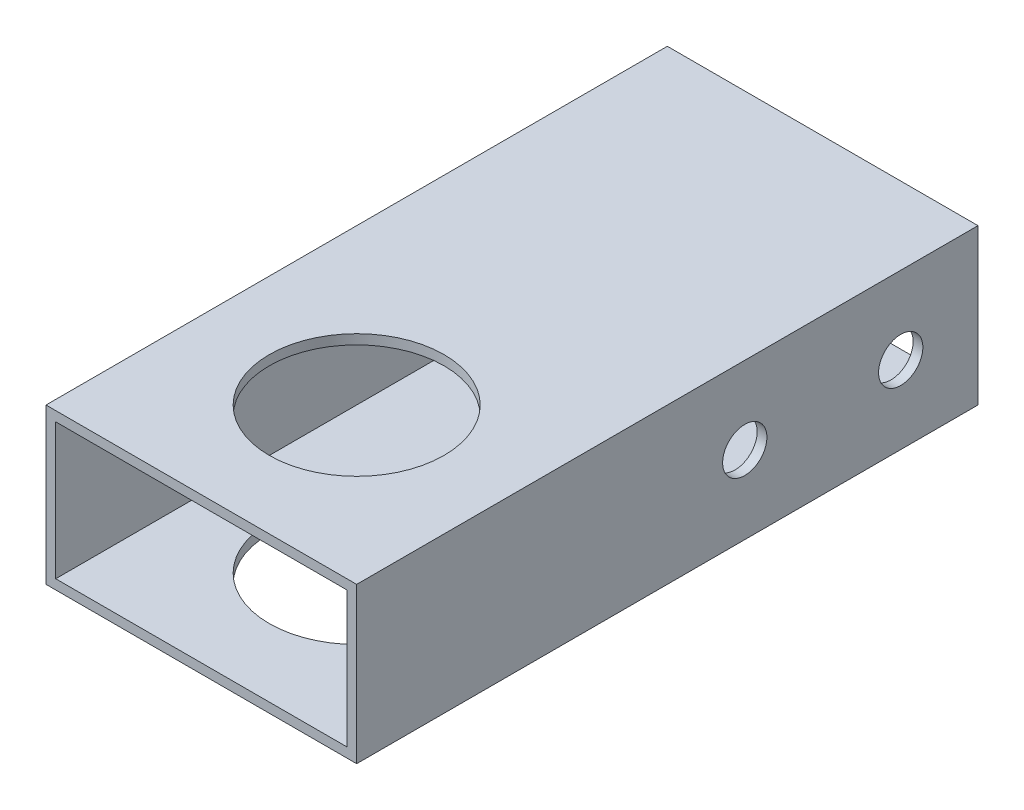
ISO-10303-21;
HEADER;
FILE_DESCRIPTION(('STEP AP214'),'2;1');
FILE_NAME('part.step','',(''),(''),'','','');
FILE_SCHEMA(('AUTOMOTIVE_DESIGN { 1 0 10303 214 1 1 1 1 }'));
ENDSEC;
DATA;
#1=APPLICATION_CONTEXT('core data for automotive mechanical design processes');
#2=APPLICATION_PROTOCOL_DEFINITION('international standard','automotive_design',2000,#1);
#3=PRODUCT_CONTEXT('',#1,'mechanical');
#4=PRODUCT('Part','Part','',(#3));
#5=PRODUCT_RELATED_PRODUCT_CATEGORY('part','',(#4));
#6=PRODUCT_DEFINITION_FORMATION('','',#4);
#7=PRODUCT_DEFINITION_CONTEXT('part definition',#1,'design');
#8=PRODUCT_DEFINITION('design','',#6,#7);
#9=PRODUCT_DEFINITION_SHAPE('','',#8);
#10=(LENGTH_UNIT() NAMED_UNIT(*) SI_UNIT(.MILLI.,.METRE.));
#11=(NAMED_UNIT(*) PLANE_ANGLE_UNIT() SI_UNIT($,.RADIAN.));
#12=(NAMED_UNIT(*) SI_UNIT($,.STERADIAN.) SOLID_ANGLE_UNIT());
#13=UNCERTAINTY_MEASURE_WITH_UNIT(LENGTH_MEASURE(1.E-05),#10,'distance_accuracy_value','');
#14=(GEOMETRIC_REPRESENTATION_CONTEXT(3) GLOBAL_UNCERTAINTY_ASSIGNED_CONTEXT((#13)) GLOBAL_UNIT_ASSIGNED_CONTEXT((#10,
#11,#12)) REPRESENTATION_CONTEXT('',''));
#15=CARTESIAN_POINT('',(0.,0.,0.));
#16=DIRECTION('',(0.,0.,1.));
#17=DIRECTION('',(1.,0.,0.));
#18=AXIS2_PLACEMENT_3D('',#15,#16,#17);
#19=CARTESIAN_POINT('',(0.,0.,101.6));
#20=DIRECTION('',(0.,0.,1.));
#21=DIRECTION('',(1.,0.,0.));
#22=AXIS2_PLACEMENT_3D('',#19,#20,#21);
#23=PLANE('',#22);
#24=DIRECTION('',(0.,-1.,0.));
#25=VECTOR('',#24,1.);
#26=CARTESIAN_POINT('',(-25.4,-12.7,101.6));
#27=LINE('',#26,#25);
#28=CARTESIAN_POINT('',(-25.4,12.7,101.6));
#29=VERTEX_POINT('',#28);
#30=CARTESIAN_POINT('',(-25.4,-12.7,101.6));
#31=VERTEX_POINT('',#30);
#32=EDGE_CURVE('E138',#29,#31,#27,.T.);
#33=ORIENTED_EDGE('',*,*,#32,.T.);
#34=DIRECTION('',(1.,0.,0.));
#35=VECTOR('',#34,1.);
#36=CARTESIAN_POINT('',(25.4,-12.7,101.6));
#37=LINE('',#36,#35);
#38=CARTESIAN_POINT('',(25.4,-12.7,101.6));
#39=VERTEX_POINT('',#38);
#40=EDGE_CURVE('E141',#31,#39,#37,.T.);
#41=ORIENTED_EDGE('',*,*,#40,.T.);
#42=DIRECTION('',(0.,1.,0.));
#43=VECTOR('',#42,1.);
#44=CARTESIAN_POINT('',(25.4,-12.7,101.6));
#45=LINE('',#44,#43);
#46=CARTESIAN_POINT('',(25.4,12.7,101.6));
#47=VERTEX_POINT('',#46);
#48=EDGE_CURVE('E144',#39,#47,#45,.T.);
#49=ORIENTED_EDGE('',*,*,#48,.T.);
#50=DIRECTION('',(-1.,0.,0.));
#51=VECTOR('',#50,1.);
#52=CARTESIAN_POINT('',(25.4,12.7,101.6));
#53=LINE('',#52,#51);
#54=EDGE_CURVE('E146',#47,#29,#53,.T.);
#55=ORIENTED_EDGE('',*,*,#54,.T.);
#56=EDGE_LOOP('',(#33,#41,#49,#55));
#57=FACE_BOUND('',#56,.T.);
#58=DIRECTION('',(1.,0.,0.));
#59=VECTOR('',#58,1.);
#60=CARTESIAN_POINT('',(23.8125,-11.1125,101.6));
#61=LINE('',#60,#59);
#62=CARTESIAN_POINT('',(-23.8125,-11.1125,101.6));
#63=VERTEX_POINT('',#62);
#64=CARTESIAN_POINT('',(23.8125,-11.1125,101.6));
#65=VERTEX_POINT('',#64);
#66=EDGE_CURVE('E108',#63,#65,#61,.T.);
#67=ORIENTED_EDGE('',*,*,#66,.F.);
#68=DIRECTION('',(0.,-1.,0.));
#69=VECTOR('',#68,1.);
#70=CARTESIAN_POINT('',(-23.8125,-11.1125,101.6));
#71=LINE('',#70,#69);
#72=CARTESIAN_POINT('',(-23.8125,11.1125,101.6));
#73=VERTEX_POINT('',#72);
#74=EDGE_CURVE('E100',#73,#63,#71,.T.);
#75=ORIENTED_EDGE('',*,*,#74,.F.);
#76=DIRECTION('',(-1.,0.,0.));
#77=VECTOR('',#76,1.);
#78=CARTESIAN_POINT('',(23.8125,11.1125,101.6));
#79=LINE('',#78,#77);
#80=CARTESIAN_POINT('',(23.8125,11.1125,101.6));
#81=VERTEX_POINT('',#80);
#82=EDGE_CURVE('E122',#81,#73,#79,.T.);
#83=ORIENTED_EDGE('',*,*,#82,.F.);
#84=DIRECTION('',(0.,1.,0.));
#85=VECTOR('',#84,1.);
#86=CARTESIAN_POINT('',(23.8125,-11.1125,101.6));
#87=LINE('',#86,#85);
#88=EDGE_CURVE('E120',#65,#81,#87,.T.);
#89=ORIENTED_EDGE('',*,*,#88,.F.);
#90=EDGE_LOOP('',(#67,#75,#83,#89));
#91=FACE_BOUND('',#90,.T.);
#92=ADVANCED_FACE('F33',(#57,#91),#23,.T.);
#93=CARTESIAN_POINT('',(0.,0.,0.));
#94=DIRECTION('',(0.,0.,1.));
#95=DIRECTION('',(1.,0.,0.));
#96=AXIS2_PLACEMENT_3D('',#93,#94,#95);
#97=PLANE('',#96);
#98=DIRECTION('',(0.,-1.,0.));
#99=VECTOR('',#98,1.);
#100=CARTESIAN_POINT('',(-25.4,-12.7,0.));
#101=LINE('',#100,#99);
#102=CARTESIAN_POINT('',(-25.4,12.7,0.));
#103=VERTEX_POINT('',#102);
#104=CARTESIAN_POINT('',(-25.4,-12.7,0.));
#105=VERTEX_POINT('',#104);
#106=EDGE_CURVE('E116',#103,#105,#101,.T.);
#107=ORIENTED_EDGE('',*,*,#106,.F.);
#108=DIRECTION('',(-1.,0.,0.));
#109=VECTOR('',#108,1.);
#110=CARTESIAN_POINT('',(25.4,12.7,0.));
#111=LINE('',#110,#109);
#112=CARTESIAN_POINT('',(25.4,12.7,0.));
#113=VERTEX_POINT('',#112);
#114=EDGE_CURVE('E142',#113,#103,#111,.T.);
#115=ORIENTED_EDGE('',*,*,#114,.F.);
#116=DIRECTION('',(0.,1.,0.));
#117=VECTOR('',#116,1.);
#118=CARTESIAN_POINT('',(25.4,-12.7,0.));
#119=LINE('',#118,#117);
#120=CARTESIAN_POINT('',(25.4,-12.7,0.));
#121=VERTEX_POINT('',#120);
#122=EDGE_CURVE('E153',#121,#113,#119,.T.);
#123=ORIENTED_EDGE('',*,*,#122,.F.);
#124=DIRECTION('',(1.,0.,0.));
#125=VECTOR('',#124,1.);
#126=CARTESIAN_POINT('',(25.4,-12.7,0.));
#127=LINE('',#126,#125);
#128=EDGE_CURVE('E151',#105,#121,#127,.T.);
#129=ORIENTED_EDGE('',*,*,#128,.F.);
#130=EDGE_LOOP('',(#107,#115,#123,#129));
#131=FACE_BOUND('',#130,.T.);
#132=DIRECTION('',(0.,-1.,0.));
#133=VECTOR('',#132,1.);
#134=CARTESIAN_POINT('',(-23.8125,-11.1125,0.));
#135=LINE('',#134,#133);
#136=CARTESIAN_POINT('',(-23.8125,11.1125,0.));
#137=VERTEX_POINT('',#136);
#138=CARTESIAN_POINT('',(-23.8125,-11.1125,0.));
#139=VERTEX_POINT('',#138);
#140=EDGE_CURVE('E58',#137,#139,#135,.T.);
#141=ORIENTED_EDGE('',*,*,#140,.T.);
#142=DIRECTION('',(1.,0.,0.));
#143=VECTOR('',#142,1.);
#144=CARTESIAN_POINT('',(23.8125,-11.1125,0.));
#145=LINE('',#144,#143);
#146=CARTESIAN_POINT('',(23.8125,-11.1125,0.));
#147=VERTEX_POINT('',#146);
#148=EDGE_CURVE('E115',#139,#147,#145,.T.);
#149=ORIENTED_EDGE('',*,*,#148,.T.);
#150=DIRECTION('',(0.,1.,0.));
#151=VECTOR('',#150,1.);
#152=CARTESIAN_POINT('',(23.8125,-11.1125,0.));
#153=LINE('',#152,#151);
#154=CARTESIAN_POINT('',(23.8125,11.1125,0.));
#155=VERTEX_POINT('',#154);
#156=EDGE_CURVE('E130',#147,#155,#153,.T.);
#157=ORIENTED_EDGE('',*,*,#156,.T.);
#158=DIRECTION('',(-1.,0.,0.));
#159=VECTOR('',#158,1.);
#160=CARTESIAN_POINT('',(23.8125,11.1125,0.));
#161=LINE('',#160,#159);
#162=EDGE_CURVE('E109',#155,#137,#161,.T.);
#163=ORIENTED_EDGE('',*,*,#162,.T.);
#164=EDGE_LOOP('',(#141,#149,#157,#163));
#165=FACE_BOUND('',#164,.T.);
#166=ADVANCED_FACE('F215',(#131,#165),#97,.F.);
#167=CARTESIAN_POINT('',(-25.4,-12.7,101.6));
#168=DIRECTION('',(1.,0.,0.));
#169=DIRECTION('',(0.,0.,-1.));
#170=AXIS2_PLACEMENT_3D('',#167,#168,#169);
#171=PLANE('',#170);
#172=CARTESIAN_POINT('',(-25.4,0.,12.6365));
#173=DIRECTION('',(1.,0.,0.));
#174=DIRECTION('',(0.,0.,-1.));
#175=AXIS2_PLACEMENT_3D('',#172,#173,#174);
#176=CIRCLE('',#175,3.61950000000001);
#177=CARTESIAN_POINT('',(-25.4,0.,9.01699999999999));
#178=VERTEX_POINT('',#177);
#179=EDGE_CURVE('E169',#178,#178,#176,.T.);
#180=ORIENTED_EDGE('',*,*,#179,.T.);
#181=EDGE_LOOP('',(#180));
#182=FACE_BOUND('',#181,.T.);
#183=CARTESIAN_POINT('',(-25.4,0.,38.1381));
#184=DIRECTION('',(1.,0.,0.));
#185=DIRECTION('',(0.,0.,-1.));
#186=AXIS2_PLACEMENT_3D('',#183,#184,#185);
#187=CIRCLE('',#186,3.61950000000001);
#188=CARTESIAN_POINT('',(-25.4,0.,34.5186));
#189=VERTEX_POINT('',#188);
#190=EDGE_CURVE('E176',#189,#189,#187,.T.);
#191=ORIENTED_EDGE('',*,*,#190,.T.);
#192=EDGE_LOOP('',(#191));
#193=FACE_BOUND('',#192,.T.);
#194=ORIENTED_EDGE('',*,*,#106,.T.);
#195=DIRECTION('',(0.,0.,-1.));
#196=VECTOR('',#195,1.);
#197=CARTESIAN_POINT('',(-25.4,-12.7,101.6));
#198=LINE('',#197,#196);
#199=EDGE_CURVE('E11',#31,#105,#198,.T.);
#200=ORIENTED_EDGE('',*,*,#199,.F.);
#201=ORIENTED_EDGE('',*,*,#32,.F.);
#202=DIRECTION('',(0.,0.,-1.));
#203=VECTOR('',#202,1.);
#204=CARTESIAN_POINT('',(-25.4,12.7,101.6));
#205=LINE('',#204,#203);
#206=EDGE_CURVE('E148',#29,#103,#205,.T.);
#207=ORIENTED_EDGE('',*,*,#206,.T.);
#208=EDGE_LOOP('',(#194,#200,#201,#207));
#209=FACE_BOUND('',#208,.T.);
#210=ADVANCED_FACE('F35',(#182,#193,#209),#171,.F.);
#211=CARTESIAN_POINT('',(25.4,-12.7,101.6));
#212=DIRECTION('',(0.,1.,0.));
#213=DIRECTION('',(-1.,0.,0.));
#214=AXIS2_PLACEMENT_3D('',#211,#212,#213);
#215=PLANE('',#214);
#216=CARTESIAN_POINT('',(0.,-12.7,76.2));
#217=DIRECTION('',(0.,-1.,0.));
#218=DIRECTION('',(1.,0.,0.));
#219=AXIS2_PLACEMENT_3D('',#216,#217,#218);
#220=CIRCLE('',#219,14.2875);
#221=CARTESIAN_POINT('',(14.2875,-12.7,76.2));
#222=VERTEX_POINT('',#221);
#223=EDGE_CURVE('E191',#222,#222,#220,.T.);
#224=ORIENTED_EDGE('',*,*,#223,.F.);
#225=EDGE_LOOP('',(#224));
#226=FACE_BOUND('',#225,.T.);
#227=ORIENTED_EDGE('',*,*,#128,.T.);
#228=DIRECTION('',(0.,0.,-1.));
#229=VECTOR('',#228,1.);
#230=CARTESIAN_POINT('',(25.4,-12.7,101.6));
#231=LINE('',#230,#229);
#232=EDGE_CURVE('E42',#39,#121,#231,.T.);
#233=ORIENTED_EDGE('',*,*,#232,.F.);
#234=ORIENTED_EDGE('',*,*,#40,.F.);
#235=ORIENTED_EDGE('',*,*,#199,.T.);
#236=EDGE_LOOP('',(#227,#233,#234,#235));
#237=FACE_BOUND('',#236,.T.);
#238=ADVANCED_FACE('F229',(#226,#237),#215,.F.);
#239=CARTESIAN_POINT('',(25.4,-12.7,101.6));
#240=DIRECTION('',(-1.,0.,0.));
#241=DIRECTION('',(0.,0.,1.));
#242=AXIS2_PLACEMENT_3D('',#239,#240,#241);
#243=PLANE('',#242);
#244=CARTESIAN_POINT('',(25.4,0.,12.6365));
#245=DIRECTION('',(-1.,0.,0.));
#246=DIRECTION('',(0.,0.,1.));
#247=AXIS2_PLACEMENT_3D('',#244,#245,#246);
#248=CIRCLE('',#247,3.61950000000001);
#249=CARTESIAN_POINT('',(25.4,0.,16.256));
#250=VERTEX_POINT('',#249);
#251=EDGE_CURVE('E188',#250,#250,#248,.T.);
#252=ORIENTED_EDGE('',*,*,#251,.T.);
#253=EDGE_LOOP('',(#252));
#254=FACE_BOUND('',#253,.T.);
#255=CARTESIAN_POINT('',(25.4,0.,38.1381));
#256=DIRECTION('',(-1.,0.,0.));
#257=DIRECTION('',(0.,0.,1.));
#258=AXIS2_PLACEMENT_3D('',#255,#256,#257);
#259=CIRCLE('',#258,3.61950000000001);
#260=CARTESIAN_POINT('',(25.4,0.,41.7576));
#261=VERTEX_POINT('',#260);
#262=EDGE_CURVE('E173',#261,#261,#259,.T.);
#263=ORIENTED_EDGE('',*,*,#262,.T.);
#264=EDGE_LOOP('',(#263));
#265=FACE_BOUND('',#264,.T.);
#266=ORIENTED_EDGE('',*,*,#122,.T.);
#267=DIRECTION('',(0.,0.,-1.));
#268=VECTOR('',#267,1.);
#269=CARTESIAN_POINT('',(25.4,12.7,101.6));
#270=LINE('',#269,#268);
#271=EDGE_CURVE('E158',#47,#113,#270,.T.);
#272=ORIENTED_EDGE('',*,*,#271,.F.);
#273=ORIENTED_EDGE('',*,*,#48,.F.);
#274=ORIENTED_EDGE('',*,*,#232,.T.);
#275=EDGE_LOOP('',(#266,#272,#273,#274));
#276=FACE_BOUND('',#275,.T.);
#277=ADVANCED_FACE('F226',(#254,#265,#276),#243,.F.);
#278=CARTESIAN_POINT('',(25.4,12.7,101.6));
#279=DIRECTION('',(0.,-1.,0.));
#280=DIRECTION('',(1.,0.,0.));
#281=AXIS2_PLACEMENT_3D('',#278,#279,#280);
#282=PLANE('',#281);
#283=CARTESIAN_POINT('',(0.,12.7,76.2));
#284=DIRECTION('',(0.,-1.,0.));
#285=DIRECTION('',(1.,0.,0.));
#286=AXIS2_PLACEMENT_3D('',#283,#284,#285);
#287=CIRCLE('',#286,14.2875);
#288=CARTESIAN_POINT('',(14.2875,12.7,76.2));
#289=VERTEX_POINT('',#288);
#290=EDGE_CURVE('E165',#289,#289,#287,.T.);
#291=ORIENTED_EDGE('',*,*,#290,.T.);
#292=EDGE_LOOP('',(#291));
#293=FACE_BOUND('',#292,.T.);
#294=ORIENTED_EDGE('',*,*,#114,.T.);
#295=ORIENTED_EDGE('',*,*,#206,.F.);
#296=ORIENTED_EDGE('',*,*,#54,.F.);
#297=ORIENTED_EDGE('',*,*,#271,.T.);
#298=EDGE_LOOP('',(#294,#295,#296,#297));
#299=FACE_BOUND('',#298,.T.);
#300=ADVANCED_FACE('F211',(#293,#299),#282,.F.);
#301=CARTESIAN_POINT('',(-23.8125,-11.1125,101.6));
#302=DIRECTION('',(1.,0.,0.));
#303=DIRECTION('',(0.,0.,-1.));
#304=AXIS2_PLACEMENT_3D('',#301,#302,#303);
#305=PLANE('',#304);
#306=CARTESIAN_POINT('',(-23.8125,0.,12.6365));
#307=DIRECTION('',(1.,0.,0.));
#308=DIRECTION('',(0.,0.,-1.));
#309=AXIS2_PLACEMENT_3D('',#306,#307,#308);
#310=CIRCLE('',#309,3.61950000000001);
#311=CARTESIAN_POINT('',(-23.8125,0.,9.01699999999999));
#312=VERTEX_POINT('',#311);
#313=EDGE_CURVE('E185',#312,#312,#310,.T.);
#314=ORIENTED_EDGE('',*,*,#313,.F.);
#315=EDGE_LOOP('',(#314));
#316=FACE_BOUND('',#315,.T.);
#317=CARTESIAN_POINT('',(-23.8125,0.,38.1381));
#318=DIRECTION('',(1.,0.,0.));
#319=DIRECTION('',(0.,0.,-1.));
#320=AXIS2_PLACEMENT_3D('',#317,#318,#319);
#321=CIRCLE('',#320,3.61950000000001);
#322=CARTESIAN_POINT('',(-23.8125,0.,34.5186));
#323=VERTEX_POINT('',#322);
#324=EDGE_CURVE('E168',#323,#323,#321,.T.);
#325=ORIENTED_EDGE('',*,*,#324,.F.);
#326=EDGE_LOOP('',(#325));
#327=FACE_BOUND('',#326,.T.);
#328=ORIENTED_EDGE('',*,*,#140,.F.);
#329=DIRECTION('',(0.,0.,-1.));
#330=VECTOR('',#329,1.);
#331=CARTESIAN_POINT('',(-23.8125,11.1125,101.6));
#332=LINE('',#331,#330);
#333=EDGE_CURVE('E104',#73,#137,#332,.T.);
#334=ORIENTED_EDGE('',*,*,#333,.F.);
#335=ORIENTED_EDGE('',*,*,#74,.T.);
#336=DIRECTION('',(0.,0.,-1.));
#337=VECTOR('',#336,1.);
#338=CARTESIAN_POINT('',(-23.8125,-11.1125,101.6));
#339=LINE('',#338,#337);
#340=EDGE_CURVE('E103',#63,#139,#339,.T.);
#341=ORIENTED_EDGE('',*,*,#340,.T.);
#342=EDGE_LOOP('',(#328,#334,#335,#341));
#343=FACE_BOUND('',#342,.T.);
#344=ADVANCED_FACE('F102',(#316,#327,#343),#305,.T.);
#345=CARTESIAN_POINT('',(23.8125,-11.1125,101.6));
#346=DIRECTION('',(0.,1.,0.));
#347=DIRECTION('',(-1.,0.,0.));
#348=AXIS2_PLACEMENT_3D('',#345,#346,#347);
#349=PLANE('',#348);
#350=CARTESIAN_POINT('',(0.,-11.1125,76.2));
#351=DIRECTION('',(0.,1.,0.));
#352=DIRECTION('',(-1.,0.,0.));
#353=AXIS2_PLACEMENT_3D('',#350,#351,#352);
#354=CIRCLE('',#353,14.2875);
#355=CARTESIAN_POINT('',(-14.2875,-11.1125,76.2));
#356=VERTEX_POINT('',#355);
#357=EDGE_CURVE('E128',#356,#356,#354,.T.);
#358=ORIENTED_EDGE('',*,*,#357,.F.);
#359=EDGE_LOOP('',(#358));
#360=FACE_BOUND('',#359,.T.);
#361=ORIENTED_EDGE('',*,*,#148,.F.);
#362=ORIENTED_EDGE('',*,*,#340,.F.);
#363=ORIENTED_EDGE('',*,*,#66,.T.);
#364=DIRECTION('',(0.,0.,-1.));
#365=VECTOR('',#364,1.);
#366=CARTESIAN_POINT('',(23.8125,-11.1125,101.6));
#367=LINE('',#366,#365);
#368=EDGE_CURVE('E117',#65,#147,#367,.T.);
#369=ORIENTED_EDGE('',*,*,#368,.T.);
#370=EDGE_LOOP('',(#361,#362,#363,#369));
#371=FACE_BOUND('',#370,.T.);
#372=ADVANCED_FACE('F112',(#360,#371),#349,.T.);
#373=CARTESIAN_POINT('',(23.8125,-11.1125,101.6));
#374=DIRECTION('',(-1.,0.,0.));
#375=DIRECTION('',(0.,0.,1.));
#376=AXIS2_PLACEMENT_3D('',#373,#374,#375);
#377=PLANE('',#376);
#378=CARTESIAN_POINT('',(23.8125,0.,12.6365));
#379=DIRECTION('',(-1.,0.,0.));
#380=DIRECTION('',(0.,0.,1.));
#381=AXIS2_PLACEMENT_3D('',#378,#379,#380);
#382=CIRCLE('',#381,3.61950000000001);
#383=CARTESIAN_POINT('',(23.8125,0.,16.256));
#384=VERTEX_POINT('',#383);
#385=EDGE_CURVE('E37',#384,#384,#382,.T.);
#386=ORIENTED_EDGE('',*,*,#385,.F.);
#387=EDGE_LOOP('',(#386));
#388=FACE_BOUND('',#387,.T.);
#389=CARTESIAN_POINT('',(23.8125,0.,38.1381));
#390=DIRECTION('',(-1.,0.,0.));
#391=DIRECTION('',(0.,0.,1.));
#392=AXIS2_PLACEMENT_3D('',#389,#390,#391);
#393=CIRCLE('',#392,3.61950000000001);
#394=CARTESIAN_POINT('',(23.8125,0.,41.7576));
#395=VERTEX_POINT('',#394);
#396=EDGE_CURVE('E166',#395,#395,#393,.T.);
#397=ORIENTED_EDGE('',*,*,#396,.F.);
#398=EDGE_LOOP('',(#397));
#399=FACE_BOUND('',#398,.T.);
#400=ORIENTED_EDGE('',*,*,#156,.F.);
#401=ORIENTED_EDGE('',*,*,#368,.F.);
#402=ORIENTED_EDGE('',*,*,#88,.T.);
#403=DIRECTION('',(0.,0.,-1.));
#404=VECTOR('',#403,1.);
#405=CARTESIAN_POINT('',(23.8125,11.1125,101.6));
#406=LINE('',#405,#404);
#407=EDGE_CURVE('E50',#81,#155,#406,.T.);
#408=ORIENTED_EDGE('',*,*,#407,.T.);
#409=EDGE_LOOP('',(#400,#401,#402,#408));
#410=FACE_BOUND('',#409,.T.);
#411=ADVANCED_FACE('F202',(#388,#399,#410),#377,.T.);
#412=CARTESIAN_POINT('',(23.8125,11.1125,101.6));
#413=DIRECTION('',(0.,-1.,0.));
#414=DIRECTION('',(1.,0.,0.));
#415=AXIS2_PLACEMENT_3D('',#412,#413,#414);
#416=PLANE('',#415);
#417=CARTESIAN_POINT('',(0.,11.1125,76.2));
#418=DIRECTION('',(0.,-1.,0.));
#419=DIRECTION('',(1.,0.,0.));
#420=AXIS2_PLACEMENT_3D('',#417,#418,#419);
#421=CIRCLE('',#420,14.2875);
#422=CARTESIAN_POINT('',(14.2875,11.1125,76.2));
#423=VERTEX_POINT('',#422);
#424=EDGE_CURVE('E163',#423,#423,#421,.T.);
#425=ORIENTED_EDGE('',*,*,#424,.F.);
#426=EDGE_LOOP('',(#425));
#427=FACE_BOUND('',#426,.T.);
#428=ORIENTED_EDGE('',*,*,#162,.F.);
#429=ORIENTED_EDGE('',*,*,#407,.F.);
#430=ORIENTED_EDGE('',*,*,#82,.T.);
#431=ORIENTED_EDGE('',*,*,#333,.T.);
#432=EDGE_LOOP('',(#428,#429,#430,#431));
#433=FACE_BOUND('',#432,.T.);
#434=ADVANCED_FACE('F208',(#427,#433),#416,.T.);
#435=CARTESIAN_POINT('',(0.,12.7,76.2));
#436=DIRECTION('',(0.,-1.,0.));
#437=DIRECTION('',(1.,0.,0.));
#438=AXIS2_PLACEMENT_3D('',#435,#436,#437);
#439=CYLINDRICAL_SURFACE('',#438,14.2875);
#440=ORIENTED_EDGE('',*,*,#424,.T.);
#441=EDGE_LOOP('',(#440));
#442=FACE_BOUND('',#441,.T.);
#443=ORIENTED_EDGE('',*,*,#290,.F.);
#444=EDGE_LOOP('',(#443));
#445=FACE_BOUND('',#444,.T.);
#446=ADVANCED_FACE('F254',(#442,#445),#439,.F.);
#447=ORIENTED_EDGE('',*,*,#357,.T.);
#448=EDGE_LOOP('',(#447));
#449=FACE_BOUND('',#448,.T.);
#450=ORIENTED_EDGE('',*,*,#223,.T.);
#451=EDGE_LOOP('',(#450));
#452=FACE_BOUND('',#451,.T.);
#453=ADVANCED_FACE('F198',(#449,#452),#439,.F.);
#454=CARTESIAN_POINT('',(-25.4,0.,38.1381));
#455=DIRECTION('',(1.,0.,0.));
#456=DIRECTION('',(0.,0.,-1.));
#457=AXIS2_PLACEMENT_3D('',#454,#455,#456);
#458=CYLINDRICAL_SURFACE('',#457,3.61950000000001);
#459=ORIENTED_EDGE('',*,*,#396,.T.);
#460=EDGE_LOOP('',(#459));
#461=FACE_BOUND('',#460,.T.);
#462=ORIENTED_EDGE('',*,*,#262,.F.);
#463=EDGE_LOOP('',(#462));
#464=FACE_BOUND('',#463,.T.);
#465=ADVANCED_FACE('F264',(#461,#464),#458,.F.);
#466=CARTESIAN_POINT('',(-25.4,0.,12.6365));
#467=DIRECTION('',(1.,0.,0.));
#468=DIRECTION('',(0.,0.,-1.));
#469=AXIS2_PLACEMENT_3D('',#466,#467,#468);
#470=CYLINDRICAL_SURFACE('',#469,3.61950000000001);
#471=ORIENTED_EDGE('',*,*,#385,.T.);
#472=EDGE_LOOP('',(#471));
#473=FACE_BOUND('',#472,.T.);
#474=ORIENTED_EDGE('',*,*,#251,.F.);
#475=EDGE_LOOP('',(#474));
#476=FACE_BOUND('',#475,.T.);
#477=ADVANCED_FACE('F267',(#473,#476),#470,.F.);
#478=ORIENTED_EDGE('',*,*,#324,.T.);
#479=EDGE_LOOP('',(#478));
#480=FACE_BOUND('',#479,.T.);
#481=ORIENTED_EDGE('',*,*,#190,.F.);
#482=EDGE_LOOP('',(#481));
#483=FACE_BOUND('',#482,.T.);
#484=ADVANCED_FACE('F268',(#480,#483),#458,.F.);
#485=ORIENTED_EDGE('',*,*,#313,.T.);
#486=EDGE_LOOP('',(#485));
#487=FACE_BOUND('',#486,.T.);
#488=ORIENTED_EDGE('',*,*,#179,.F.);
#489=EDGE_LOOP('',(#488));
#490=FACE_BOUND('',#489,.T.);
#491=ADVANCED_FACE('F271',(#487,#490),#470,.F.);
#492=CLOSED_SHELL('',(#92,#166,#210,#238,#277,#300,#344,#372,#411,#434,#446,#453,#465,#477,#484,#491));
#493=MANIFOLD_SOLID_BREP('B2',#492);
#494=ADVANCED_BREP_SHAPE_REPRESENTATION('',(#18,#493),#14);
#495=SHAPE_DEFINITION_REPRESENTATION(#9,#494);
ENDSEC;
END-ISO-10303-21;
